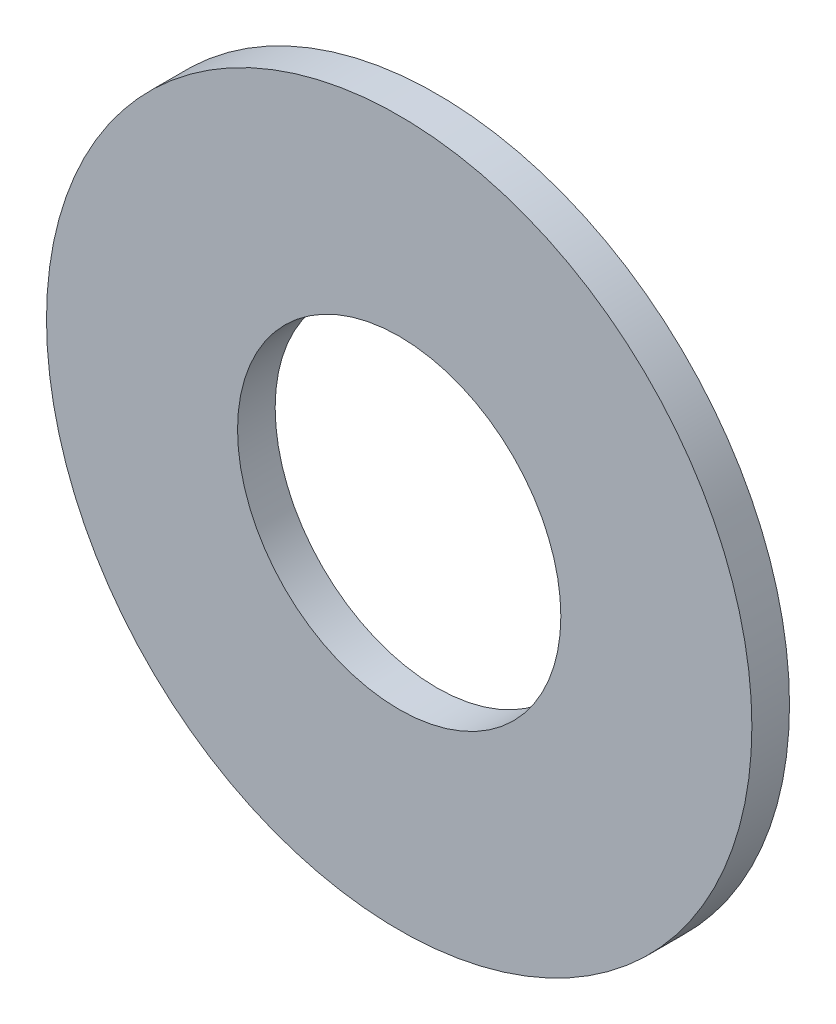
ISO-10303-21;
HEADER;
FILE_DESCRIPTION(('STEP AP214'),'2;1');
FILE_NAME('part.step','',(''),(''),'','','');
FILE_SCHEMA(('AUTOMOTIVE_DESIGN { 1 0 10303 214 1 1 1 1 }'));
ENDSEC;
DATA;
#1=APPLICATION_CONTEXT('core data for automotive mechanical design processes');
#2=APPLICATION_PROTOCOL_DEFINITION('international standard','automotive_design',2000,#1);
#3=PRODUCT_CONTEXT('',#1,'mechanical');
#4=PRODUCT('Part','Part','',(#3));
#5=PRODUCT_RELATED_PRODUCT_CATEGORY('part','',(#4));
#6=PRODUCT_DEFINITION_FORMATION('','',#4);
#7=PRODUCT_DEFINITION_CONTEXT('part definition',#1,'design');
#8=PRODUCT_DEFINITION('design','',#6,#7);
#9=PRODUCT_DEFINITION_SHAPE('','',#8);
#10=(LENGTH_UNIT() NAMED_UNIT(*) SI_UNIT(.MILLI.,.METRE.));
#11=(NAMED_UNIT(*) PLANE_ANGLE_UNIT() SI_UNIT($,.RADIAN.));
#12=(NAMED_UNIT(*) SI_UNIT($,.STERADIAN.) SOLID_ANGLE_UNIT());
#13=UNCERTAINTY_MEASURE_WITH_UNIT(LENGTH_MEASURE(1.E-05),#10,'distance_accuracy_value','');
#14=(GEOMETRIC_REPRESENTATION_CONTEXT(3) GLOBAL_UNCERTAINTY_ASSIGNED_CONTEXT((#13)) GLOBAL_UNIT_ASSIGNED_CONTEXT((#10,
#11,#12)) REPRESENTATION_CONTEXT('',''));
#15=CARTESIAN_POINT('',(0.,0.,0.));
#16=DIRECTION('',(0.,0.,1.));
#17=DIRECTION('',(1.,0.,0.));
#18=AXIS2_PLACEMENT_3D('',#15,#16,#17);
#19=CARTESIAN_POINT('',(0.,0.,-1.016));
#20=DIRECTION('',(0.,0.,1.));
#21=DIRECTION('',(1.,0.,0.));
#22=AXIS2_PLACEMENT_3D('',#19,#20,#21);
#23=CYLINDRICAL_SURFACE('',#22,9.525);
#24=CARTESIAN_POINT('',(0.,0.,-1.016));
#25=DIRECTION('',(0.,0.,1.));
#26=DIRECTION('',(1.,0.,0.));
#27=AXIS2_PLACEMENT_3D('',#24,#25,#26);
#28=CIRCLE('',#27,9.525);
#29=CARTESIAN_POINT('',(9.525,0.,-1.016));
#30=VERTEX_POINT('',#29);
#31=EDGE_CURVE('E10',#30,#30,#28,.T.);
#32=ORIENTED_EDGE('',*,*,#31,.T.);
#33=EDGE_LOOP('',(#32));
#34=FACE_BOUND('',#33,.T.);
#35=CARTESIAN_POINT('',(0.,0.,0.));
#36=DIRECTION('',(0.,0.,1.));
#37=DIRECTION('',(1.,0.,0.));
#38=AXIS2_PLACEMENT_3D('',#35,#36,#37);
#39=CIRCLE('',#38,9.525);
#40=CARTESIAN_POINT('',(9.525,0.,0.));
#41=VERTEX_POINT('',#40);
#42=EDGE_CURVE('E40',#41,#41,#39,.T.);
#43=ORIENTED_EDGE('',*,*,#42,.F.);
#44=EDGE_LOOP('',(#43));
#45=FACE_BOUND('',#44,.T.);
#46=ADVANCED_FACE('F37',(#34,#45),#23,.T.);
#47=CARTESIAN_POINT('',(0.,0.,-1.016));
#48=DIRECTION('',(0.,0.,1.));
#49=DIRECTION('',(1.,0.,0.));
#50=AXIS2_PLACEMENT_3D('',#47,#48,#49);
#51=PLANE('',#50);
#52=CARTESIAN_POINT('',(0.,0.,-1.016));
#53=DIRECTION('',(0.,0.,1.));
#54=DIRECTION('',(1.,0.,0.));
#55=AXIS2_PLACEMENT_3D('',#52,#53,#54);
#56=CIRCLE('',#55,4.365625);
#57=CARTESIAN_POINT('',(4.365625,0.,-1.016));
#58=VERTEX_POINT('',#57);
#59=EDGE_CURVE('E50',#58,#58,#56,.T.);
#60=ORIENTED_EDGE('',*,*,#59,.T.);
#61=EDGE_LOOP('',(#60));
#62=FACE_BOUND('',#61,.T.);
#63=ORIENTED_EDGE('',*,*,#31,.F.);
#64=EDGE_LOOP('',(#63));
#65=FACE_BOUND('',#64,.T.);
#66=ADVANCED_FACE('F59',(#62,#65),#51,.F.);
#67=CARTESIAN_POINT('',(0.,0.,0.));
#68=DIRECTION('',(0.,0.,1.));
#69=DIRECTION('',(1.,0.,0.));
#70=AXIS2_PLACEMENT_3D('',#67,#68,#69);
#71=PLANE('',#70);
#72=CARTESIAN_POINT('',(0.,0.,0.));
#73=DIRECTION('',(0.,0.,1.));
#74=DIRECTION('',(1.,0.,0.));
#75=AXIS2_PLACEMENT_3D('',#72,#73,#74);
#76=CIRCLE('',#75,4.365625);
#77=CARTESIAN_POINT('',(4.365625,0.,0.));
#78=VERTEX_POINT('',#77);
#79=EDGE_CURVE('E52',#78,#78,#76,.T.);
#80=ORIENTED_EDGE('',*,*,#79,.F.);
#81=EDGE_LOOP('',(#80));
#82=FACE_BOUND('',#81,.T.);
#83=ORIENTED_EDGE('',*,*,#42,.T.);
#84=EDGE_LOOP('',(#83));
#85=FACE_BOUND('',#84,.T.);
#86=ADVANCED_FACE('F65',(#82,#85),#71,.T.);
#87=CARTESIAN_POINT('',(0.,0.,-1.016));
#88=DIRECTION('',(0.,0.,1.));
#89=DIRECTION('',(1.,0.,0.));
#90=AXIS2_PLACEMENT_3D('',#87,#88,#89);
#91=CYLINDRICAL_SURFACE('',#90,4.365625);
#92=ORIENTED_EDGE('',*,*,#59,.F.);
#93=EDGE_LOOP('',(#92));
#94=FACE_BOUND('',#93,.T.);
#95=ORIENTED_EDGE('',*,*,#79,.T.);
#96=EDGE_LOOP('',(#95));
#97=FACE_BOUND('',#96,.T.);
#98=ADVANCED_FACE('F62',(#94,#97),#91,.F.);
#99=CLOSED_SHELL('',(#46,#66,#86,#98));
#100=MANIFOLD_SOLID_BREP('B2',#99);
#101=ADVANCED_BREP_SHAPE_REPRESENTATION('',(#18,#100),#14);
#102=SHAPE_DEFINITION_REPRESENTATION(#9,#101);
ENDSEC;
END-ISO-10303-21;
